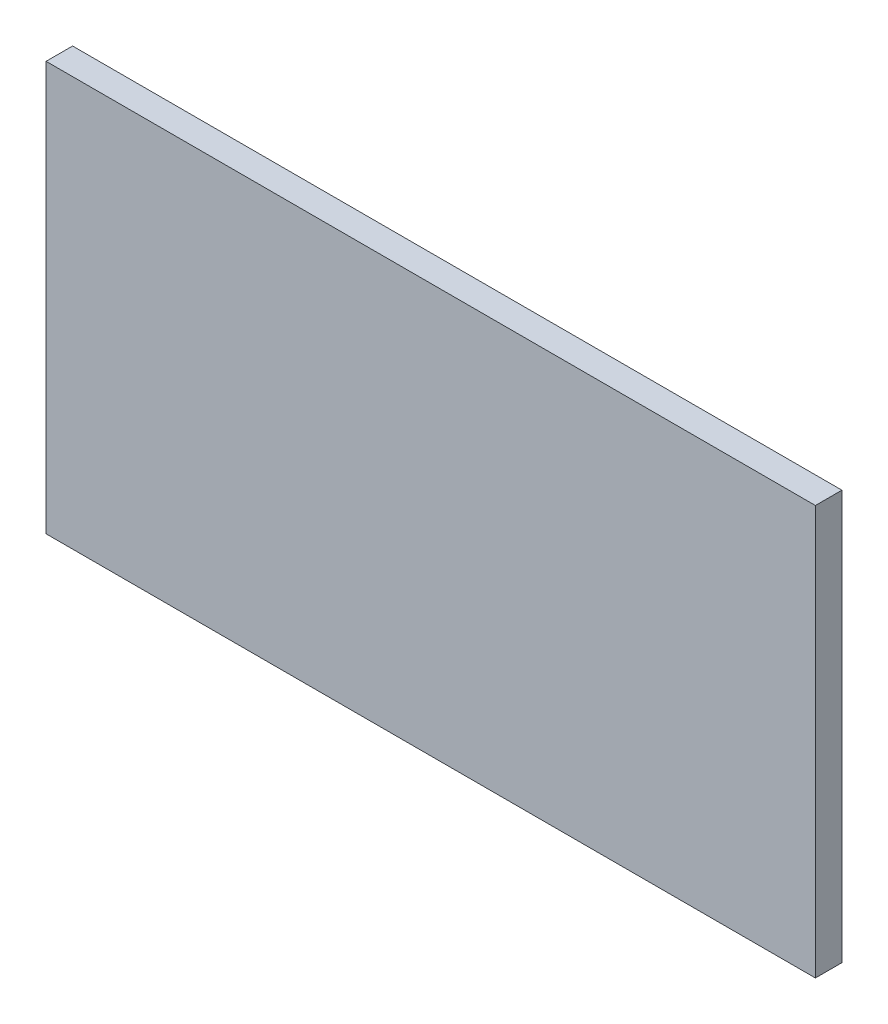
ISO-10303-21;
HEADER;
FILE_DESCRIPTION(('STEP AP214'),'2;1');
FILE_NAME('part.step','',(''),(''),'','','');
FILE_SCHEMA(('AUTOMOTIVE_DESIGN { 1 0 10303 214 1 1 1 1 }'));
ENDSEC;
DATA;
#1=APPLICATION_CONTEXT('core data for automotive mechanical design processes');
#2=APPLICATION_PROTOCOL_DEFINITION('international standard','automotive_design',2000,#1);
#3=PRODUCT_CONTEXT('',#1,'mechanical');
#4=PRODUCT('Part','Part','',(#3));
#5=PRODUCT_RELATED_PRODUCT_CATEGORY('part','',(#4));
#6=PRODUCT_DEFINITION_FORMATION('','',#4);
#7=PRODUCT_DEFINITION_CONTEXT('part definition',#1,'design');
#8=PRODUCT_DEFINITION('design','',#6,#7);
#9=PRODUCT_DEFINITION_SHAPE('','',#8);
#10=(LENGTH_UNIT() NAMED_UNIT(*) SI_UNIT(.MILLI.,.METRE.));
#11=(NAMED_UNIT(*) PLANE_ANGLE_UNIT() SI_UNIT($,.RADIAN.));
#12=(NAMED_UNIT(*) SI_UNIT($,.STERADIAN.) SOLID_ANGLE_UNIT());
#13=UNCERTAINTY_MEASURE_WITH_UNIT(LENGTH_MEASURE(1.E-05),#10,'distance_accuracy_value','');
#14=(GEOMETRIC_REPRESENTATION_CONTEXT(3) GLOBAL_UNCERTAINTY_ASSIGNED_CONTEXT((#13)) GLOBAL_UNIT_ASSIGNED_CONTEXT((#10,
#11,#12)) REPRESENTATION_CONTEXT('',''));
#15=CARTESIAN_POINT('',(0.,0.,0.));
#16=DIRECTION('',(0.,0.,1.));
#17=DIRECTION('',(1.,0.,0.));
#18=AXIS2_PLACEMENT_3D('',#15,#16,#17);
#19=CARTESIAN_POINT('',(167.13200378418,25.145999908447,0.41148));
#20=DIRECTION('',(0.,0.,1.));
#21=DIRECTION('',(1.,0.,0.));
#22=AXIS2_PLACEMENT_3D('',#19,#20,#21);
#23=PLANE('',#22);
#24=DIRECTION('',(1.,0.,0.));
#25=VECTOR('',#24,1.);
#26=CARTESIAN_POINT('',(167.13200378418,31.496000289917,0.41148));
#27=LINE('',#26,#25);
#28=CARTESIAN_POINT('',(167.13200378418,31.496000289917,0.41148));
#29=VERTEX_POINT('',#28);
#30=CARTESIAN_POINT('',(179.07000732421,31.496000289917,0.41148));
#31=VERTEX_POINT('',#30);
#32=EDGE_CURVE('E53',#29,#31,#27,.T.);
#33=ORIENTED_EDGE('',*,*,#32,.F.);
#34=DIRECTION('',(0.,1.,0.));
#35=VECTOR('',#34,1.);
#36=CARTESIAN_POINT('',(167.13200378418,25.145999908447,0.41148));
#37=LINE('',#36,#35);
#38=CARTESIAN_POINT('',(167.13200378418,25.145999908447,0.41148));
#39=VERTEX_POINT('',#38);
#40=EDGE_CURVE('E68',#39,#29,#37,.T.);
#41=ORIENTED_EDGE('',*,*,#40,.F.);
#42=DIRECTION('',(1.,0.,0.));
#43=VECTOR('',#42,1.);
#44=CARTESIAN_POINT('',(179.07000732421,25.145999908447,0.41148));
#45=LINE('',#44,#43);
#46=CARTESIAN_POINT('',(179.07000732421,25.145999908447,0.41148));
#47=VERTEX_POINT('',#46);
#48=EDGE_CURVE('E20',#47,#39,#45,.F.);
#49=ORIENTED_EDGE('',*,*,#48,.F.);
#50=DIRECTION('',(0.,1.,0.));
#51=VECTOR('',#50,1.);
#52=CARTESIAN_POINT('',(179.07000732421,31.496000289917,0.41148));
#53=LINE('',#52,#51);
#54=EDGE_CURVE('E58',#31,#47,#53,.F.);
#55=ORIENTED_EDGE('',*,*,#54,.F.);
#56=EDGE_LOOP('',(#33,#41,#49,#55));
#57=FACE_BOUND('',#56,.T.);
#58=ADVANCED_FACE('F17',(#57),#23,.T.);
#59=CARTESIAN_POINT('',(179.07000732421,25.145999908447,0.));
#60=DIRECTION('',(0.,-1.,0.));
#61=DIRECTION('',(0.,0.,-1.));
#62=AXIS2_PLACEMENT_3D('',#59,#60,#61);
#63=PLANE('',#62);
#64=DIRECTION('',(0.,0.,1.));
#65=VECTOR('',#64,1.);
#66=CARTESIAN_POINT('',(167.13200378418,25.145999908447,0.));
#67=LINE('',#66,#65);
#68=CARTESIAN_POINT('',(167.13200378418,25.145999908447,0.));
#69=VERTEX_POINT('',#68);
#70=EDGE_CURVE('E79',#69,#39,#67,.T.);
#71=ORIENTED_EDGE('',*,*,#70,.F.);
#72=DIRECTION('',(1.,0.,0.));
#73=VECTOR('',#72,1.);
#74=CARTESIAN_POINT('',(167.13200378418,25.145999908447,0.));
#75=LINE('',#74,#73);
#76=CARTESIAN_POINT('',(179.07000732421,25.145999908447,0.));
#77=VERTEX_POINT('',#76);
#78=EDGE_CURVE('E74',#69,#77,#75,.T.);
#79=ORIENTED_EDGE('',*,*,#78,.T.);
#80=DIRECTION('',(0.,0.,-1.));
#81=VECTOR('',#80,1.);
#82=CARTESIAN_POINT('',(179.07000732421,25.145999908447,0.));
#83=LINE('',#82,#81);
#84=EDGE_CURVE('E63',#47,#77,#83,.T.);
#85=ORIENTED_EDGE('',*,*,#84,.F.);
#86=ORIENTED_EDGE('',*,*,#48,.T.);
#87=EDGE_LOOP('',(#71,#79,#85,#86));
#88=FACE_BOUND('',#87,.T.);
#89=ADVANCED_FACE('F73',(#88),#63,.T.);
#90=CARTESIAN_POINT('',(179.07000732421,31.496000289917,0.));
#91=DIRECTION('',(1.,0.,0.));
#92=DIRECTION('',(0.,0.,-1.));
#93=AXIS2_PLACEMENT_3D('',#90,#91,#92);
#94=PLANE('',#93);
#95=ORIENTED_EDGE('',*,*,#84,.T.);
#96=DIRECTION('',(0.,1.,0.));
#97=VECTOR('',#96,1.);
#98=CARTESIAN_POINT('',(179.07000732421,25.145999908447,0.));
#99=LINE('',#98,#97);
#100=CARTESIAN_POINT('',(179.07000732421,31.496000289917,0.));
#101=VERTEX_POINT('',#100);
#102=EDGE_CURVE('E84',#77,#101,#99,.T.);
#103=ORIENTED_EDGE('',*,*,#102,.T.);
#104=DIRECTION('',(0.,0.,1.));
#105=VECTOR('',#104,1.);
#106=CARTESIAN_POINT('',(179.07000732421,31.496000289917,0.));
#107=LINE('',#106,#105);
#108=EDGE_CURVE('E65',#31,#101,#107,.F.);
#109=ORIENTED_EDGE('',*,*,#108,.F.);
#110=ORIENTED_EDGE('',*,*,#54,.T.);
#111=EDGE_LOOP('',(#95,#103,#109,#110));
#112=FACE_BOUND('',#111,.T.);
#113=ADVANCED_FACE('F60',(#112),#94,.T.);
#114=CARTESIAN_POINT('',(167.13200378418,31.496000289917,0.));
#115=DIRECTION('',(0.,1.,0.));
#116=DIRECTION('',(0.,0.,1.));
#117=AXIS2_PLACEMENT_3D('',#114,#115,#116);
#118=PLANE('',#117);
#119=ORIENTED_EDGE('',*,*,#108,.T.);
#120=DIRECTION('',(1.,0.,0.));
#121=VECTOR('',#120,1.);
#122=CARTESIAN_POINT('',(167.13200378418,31.496000289917,0.));
#123=LINE('',#122,#121);
#124=CARTESIAN_POINT('',(167.13200378418,31.496000289917,0.));
#125=VERTEX_POINT('',#124);
#126=EDGE_CURVE('E26',#101,#125,#123,.F.);
#127=ORIENTED_EDGE('',*,*,#126,.T.);
#128=DIRECTION('',(0.,0.,1.));
#129=VECTOR('',#128,1.);
#130=CARTESIAN_POINT('',(167.13200378418,31.496000289917,0.));
#131=LINE('',#130,#129);
#132=EDGE_CURVE('E34',#29,#125,#131,.F.);
#133=ORIENTED_EDGE('',*,*,#132,.F.);
#134=ORIENTED_EDGE('',*,*,#32,.T.);
#135=EDGE_LOOP('',(#119,#127,#133,#134));
#136=FACE_BOUND('',#135,.T.);
#137=ADVANCED_FACE('F88',(#136),#118,.T.);
#138=CARTESIAN_POINT('',(167.13200378418,25.145999908447,0.));
#139=DIRECTION('',(-1.,0.,0.));
#140=DIRECTION('',(0.,0.,1.));
#141=AXIS2_PLACEMENT_3D('',#138,#139,#140);
#142=PLANE('',#141);
#143=ORIENTED_EDGE('',*,*,#132,.T.);
#144=DIRECTION('',(0.,1.,0.));
#145=VECTOR('',#144,1.);
#146=CARTESIAN_POINT('',(167.13200378418,25.145999908447,0.));
#147=LINE('',#146,#145);
#148=EDGE_CURVE('E11',#125,#69,#147,.F.);
#149=ORIENTED_EDGE('',*,*,#148,.T.);
#150=ORIENTED_EDGE('',*,*,#70,.T.);
#151=ORIENTED_EDGE('',*,*,#40,.T.);
#152=EDGE_LOOP('',(#143,#149,#150,#151));
#153=FACE_BOUND('',#152,.T.);
#154=ADVANCED_FACE('F91',(#153),#142,.T.);
#155=CARTESIAN_POINT('',(167.13200378418,25.145999908447,0.));
#156=DIRECTION('',(0.,0.,1.));
#157=DIRECTION('',(1.,0.,0.));
#158=AXIS2_PLACEMENT_3D('',#155,#156,#157);
#159=PLANE('',#158);
#160=ORIENTED_EDGE('',*,*,#126,.F.);
#161=ORIENTED_EDGE('',*,*,#102,.F.);
#162=ORIENTED_EDGE('',*,*,#78,.F.);
#163=ORIENTED_EDGE('',*,*,#148,.F.);
#164=EDGE_LOOP('',(#160,#161,#162,#163));
#165=FACE_BOUND('',#164,.T.);
#166=ADVANCED_FACE('F90',(#165),#159,.F.);
#167=CLOSED_SHELL('',(#58,#89,#113,#137,#154,#166));
#168=MANIFOLD_SOLID_BREP('B1',#167);
#169=ADVANCED_BREP_SHAPE_REPRESENTATION('',(#18,#168),#14);
#170=SHAPE_DEFINITION_REPRESENTATION(#9,#169);
ENDSEC;
END-ISO-10303-21;
